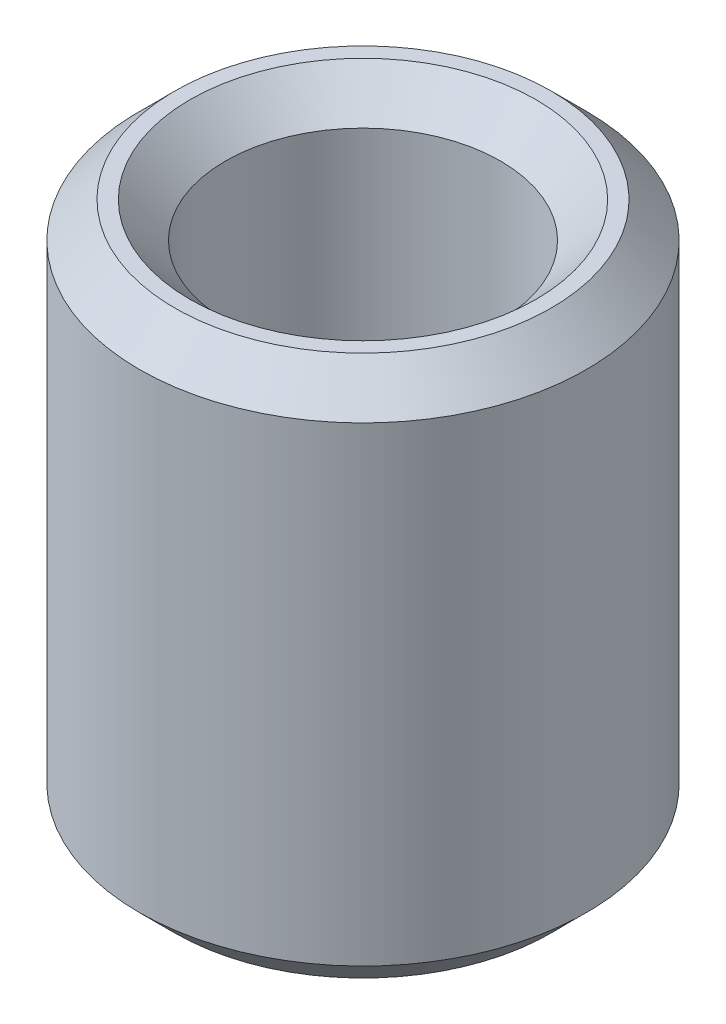
ISO-10303-21;
HEADER;
FILE_DESCRIPTION(('STEP AP214'),'2;1');
FILE_NAME('part.step','',(''),(''),'','','');
FILE_SCHEMA(('AUTOMOTIVE_DESIGN { 1 0 10303 214 1 1 1 1 }'));
ENDSEC;
DATA;
#1=APPLICATION_CONTEXT('core data for automotive mechanical design processes');
#2=APPLICATION_PROTOCOL_DEFINITION('international standard','automotive_design',2000,#1);
#3=PRODUCT_CONTEXT('',#1,'mechanical');
#4=PRODUCT('Part','Part','',(#3));
#5=PRODUCT_RELATED_PRODUCT_CATEGORY('part','',(#4));
#6=PRODUCT_DEFINITION_FORMATION('','',#4);
#7=PRODUCT_DEFINITION_CONTEXT('part definition',#1,'design');
#8=PRODUCT_DEFINITION('design','',#6,#7);
#9=PRODUCT_DEFINITION_SHAPE('','',#8);
#10=(LENGTH_UNIT() NAMED_UNIT(*) SI_UNIT(.MILLI.,.METRE.));
#11=(NAMED_UNIT(*) PLANE_ANGLE_UNIT() SI_UNIT($,.RADIAN.));
#12=(NAMED_UNIT(*) SI_UNIT($,.STERADIAN.) SOLID_ANGLE_UNIT());
#13=UNCERTAINTY_MEASURE_WITH_UNIT(LENGTH_MEASURE(1.E-05),#10,'distance_accuracy_value','');
#14=(GEOMETRIC_REPRESENTATION_CONTEXT(3) GLOBAL_UNCERTAINTY_ASSIGNED_CONTEXT((#13)) GLOBAL_UNIT_ASSIGNED_CONTEXT((#10,
#11,#12)) REPRESENTATION_CONTEXT('',''));
#15=CARTESIAN_POINT('',(0.,0.,0.));
#16=DIRECTION('',(0.,0.,1.));
#17=DIRECTION('',(1.,0.,0.));
#18=AXIS2_PLACEMENT_3D('',#15,#16,#17);
#19=CARTESIAN_POINT('',(0.,54.4717632460393,0.));
#20=DIRECTION('',(0.,-1.,0.));
#21=DIRECTION('',(0.,0.,-1.));
#22=AXIS2_PLACEMENT_3D('',#19,#20,#21);
#23=CYLINDRICAL_SURFACE('',#22,22.5);
#24=CARTESIAN_POINT('',(0.,3.56541825971917,0.));
#25=DIRECTION('',(0.,1.,0.));
#26=DIRECTION('',(0.,0.,1.));
#27=AXIS2_PLACEMENT_3D('',#24,#25,#26);
#28=CIRCLE('',#27,22.5);
#29=CARTESIAN_POINT('',(0.,3.56541825971917,-22.5));
#30=VERTEX_POINT('',#29);
#31=EDGE_CURVE('E10',#30,#30,#28,.T.);
#32=CARTESIAN_POINT('',(0.,50.9063449863202,0.));
#33=DIRECTION('',(0.,1.,0.));
#34=DIRECTION('',(0.,0.,1.));
#35=AXIS2_PLACEMENT_3D('',#32,#33,#34);
#36=CIRCLE('',#35,22.5);
#37=CARTESIAN_POINT('',(0.,50.9063449863202,-22.5));
#38=VERTEX_POINT('',#37);
#39=EDGE_CURVE('E50',#38,#38,#36,.F.);
#40=CARTESIAN_POINT('',(0.,3.56541825971917,-22.5));
#41=CARTESIAN_POINT('',(0.,4.05855291312126,-22.5));
#42=CARTESIAN_POINT('',(0.,4.55168756652336,-22.5));
#43=CARTESIAN_POINT('',(0.,5.53795687332755,-22.5));
#44=CARTESIAN_POINT('',(0.,6.03109152672964,-22.5));
#45=CARTESIAN_POINT('',(0.,7.01736083353383,-22.5));
#46=CARTESIAN_POINT('',(0.,7.51049548693592,-22.5));
#47=CARTESIAN_POINT('',(0.,8.49676479374011,-22.5));
#48=CARTESIAN_POINT('',(0.,8.98989944714221,-22.5));
#49=CARTESIAN_POINT('',(0.,9.9761687539464,-22.5));
#50=CARTESIAN_POINT('',(0.,10.4693034073485,-22.5));
#51=CARTESIAN_POINT('',(0.,11.4555727141527,-22.5));
#52=CARTESIAN_POINT('',(0.,11.9487073675548,-22.5));
#53=CARTESIAN_POINT('',(0.,12.934976674359,-22.5));
#54=CARTESIAN_POINT('',(0.,13.428111327761,-22.5));
#55=CARTESIAN_POINT('',(0.,14.4143806345652,-22.5));
#56=CARTESIAN_POINT('',(0.,14.9075152879673,-22.5));
#57=CARTESIAN_POINT('',(0.,15.8937845947715,-22.5));
#58=CARTESIAN_POINT('',(0.,16.3869192481736,-22.5));
#59=CARTESIAN_POINT('',(0.,17.3731885549778,-22.5));
#60=CARTESIAN_POINT('',(0.,17.8663232083799,-22.5));
#61=CARTESIAN_POINT('',(0.,18.8525925151841,-22.5));
#62=CARTESIAN_POINT('',(0.,19.3457271685862,-22.5));
#63=CARTESIAN_POINT('',(0.,20.3319964753904,-22.5));
#64=CARTESIAN_POINT('',(0.,20.8251311287925,-22.5));
#65=CARTESIAN_POINT('',(0.,21.8114004355966,-22.5));
#66=CARTESIAN_POINT('',(0.,22.3045350889987,-22.5));
#67=CARTESIAN_POINT('',(0.,23.2908043958029,-22.5));
#68=CARTESIAN_POINT('',(0.,23.783939049205,-22.5));
#69=CARTESIAN_POINT('',(0.,24.7702083560092,-22.5));
#70=CARTESIAN_POINT('',(0.,25.2633430094113,-22.5));
#71=CARTESIAN_POINT('',(0.,26.2496123162155,-22.5));
#72=CARTESIAN_POINT('',(0.,26.7427469696176,-22.5));
#73=CARTESIAN_POINT('',(0.,27.7290162764218,-22.5));
#74=CARTESIAN_POINT('',(0.,28.2221509298239,-22.5));
#75=CARTESIAN_POINT('',(0.,29.2084202366281,-22.5));
#76=CARTESIAN_POINT('',(0.,29.7015548900302,-22.5));
#77=CARTESIAN_POINT('',(0.,30.6878241968343,-22.5));
#78=CARTESIAN_POINT('',(0.,31.1809588502364,-22.5));
#79=CARTESIAN_POINT('',(0.,32.1672281570406,-22.5));
#80=CARTESIAN_POINT('',(0.,32.6603628104427,-22.5));
#81=CARTESIAN_POINT('',(0.,33.6466321172469,-22.5));
#82=CARTESIAN_POINT('',(0.,34.139766770649,-22.5));
#83=CARTESIAN_POINT('',(0.,35.1260360774532,-22.5));
#84=CARTESIAN_POINT('',(0.,35.6191707308553,-22.5));
#85=CARTESIAN_POINT('',(0.,36.6054400376595,-22.5));
#86=CARTESIAN_POINT('',(0.,37.0985746910616,-22.5));
#87=CARTESIAN_POINT('',(0.,38.0848439978658,-22.5));
#88=CARTESIAN_POINT('',(0.,38.5779786512678,-22.5));
#89=CARTESIAN_POINT('',(0.,39.564247958072,-22.5));
#90=CARTESIAN_POINT('',(0.,40.0573826114741,-22.5));
#91=CARTESIAN_POINT('',(0.,41.0436519182783,-22.5));
#92=CARTESIAN_POINT('',(0.,41.5367865716804,-22.5));
#93=CARTESIAN_POINT('',(0.,42.5230558784846,-22.5));
#94=CARTESIAN_POINT('',(0.,43.0161905318867,-22.5));
#95=CARTESIAN_POINT('',(0.,44.0024598386909,-22.5));
#96=CARTESIAN_POINT('',(0.,44.495594492093,-22.5));
#97=CARTESIAN_POINT('',(0.,45.4818637988972,-22.5));
#98=CARTESIAN_POINT('',(0.,45.9749984522993,-22.5));
#99=CARTESIAN_POINT('',(0.,46.9612677591034,-22.5));
#100=CARTESIAN_POINT('',(0.,47.4544024125055,-22.5));
#101=CARTESIAN_POINT('',(0.,48.4406717193097,-22.5));
#102=CARTESIAN_POINT('',(0.,48.9338063727118,-22.5));
#103=CARTESIAN_POINT('',(0.,49.920075679516,-22.5));
#104=CARTESIAN_POINT('',(0.,50.4132103329181,-22.5));
#105=CARTESIAN_POINT('',(0.,50.9063449863202,-22.5));
#106=B_SPLINE_CURVE_WITH_KNOTS('',3,(#40,#41,#42,#43,#44,#45,#46,#47,#48,#49,#50,#51,#52,#53,
#54,#55,#56,#57,#58,#59,#60,#61,#62,#63,#64,#65,#66,#67,#68,#69,#70,#71,#72,#73,#74,#75,#76,#77,
#78,#79,#80,#81,#82,#83,#84,#85,#86,#87,#88,#89,#90,#91,#92,#93,#94,#95,#96,#97,#98,#99,#100,
#101,#102,#103,#104,#105),.UNSPECIFIED.,.F.,.F.,(4,2,2,2,2,2,2,2,2,2,2,2,2,2,2,2,2,2,2,2,2,2,2,
2,2,2,2,2,2,2,2,2,4),(0.,1.47940396020628,2.95880792041257,4.43821188061885,5.91761584082513,
7.39701980103141,8.87642376123769,10.355827721444,11.8352316816503,13.3146356418565,
14.7940396020628,16.2734435622691,17.7528475224754,19.2322514826817,20.7116554428879,
22.1910594030942,23.6704633633005,25.1498673235068,26.6292712837131,28.1086752439194,
29.5880792041256,31.0674831643319,32.5468871245382,34.0262910847445,35.5056950449508,
36.985099005157,38.4645029653633,39.9439069255696,41.4233108857759,42.9027148459822,
44.3821188061885,45.8615227663947,47.340926726601),.UNSPECIFIED.);
#107=EDGE_CURVE('BSEAM39',#30,#38,#106,.T.);
#108=ORIENTED_EDGE('',*,*,#31,.T.);
#109=ORIENTED_EDGE('',*,*,#39,.T.);
#110=ORIENTED_EDGE('',*,*,#107,.T.);
#111=ORIENTED_EDGE('',*,*,#107,.F.);
#112=EDGE_LOOP('',(#108,#110,#109,#111));
#113=FACE_BOUND('',#112,.T.);
#114=ADVANCED_FACE('F39',(#113),#23,.T.);
#115=CARTESIAN_POINT('',(0.,54.4717632460393,0.));
#116=DIRECTION('',(0.,1.,0.));
#117=DIRECTION('',(0.,0.,1.));
#118=AXIS2_PLACEMENT_3D('',#115,#116,#117);
#119=PLANE('',#118);
#120=CARTESIAN_POINT('',(0.,54.4717632460393,0.));
#121=DIRECTION('',(0.,1.,0.));
#122=DIRECTION('',(0.,0.,1.));
#123=AXIS2_PLACEMENT_3D('',#120,#121,#122);
#124=CIRCLE('',#123,17.4126126283634);
#125=CARTESIAN_POINT('',(0.,54.4717632460393,17.4126126283634));
#126=VERTEX_POINT('',#125);
#127=EDGE_CURVE('E58',#126,#126,#124,.F.);
#128=ORIENTED_EDGE('',*,*,#127,.T.);
#129=EDGE_LOOP('',(#128));
#130=FACE_BOUND('',#129,.T.);
#131=CARTESIAN_POINT('',(0.,54.4717632460393,0.));
#132=DIRECTION('',(0.,1.,0.));
#133=DIRECTION('',(0.,0.,1.));
#134=AXIS2_PLACEMENT_3D('',#131,#132,#133);
#135=CIRCLE('',#134,18.9345817402809);
#136=CARTESIAN_POINT('',(0.,54.4717632460393,-18.9345817402809));
#137=VERTEX_POINT('',#136);
#138=EDGE_CURVE('E61',#137,#137,#135,.T.);
#139=ORIENTED_EDGE('',*,*,#138,.T.);
#140=EDGE_LOOP('',(#139));
#141=FACE_BOUND('',#140,.T.);
#142=ADVANCED_FACE('F88',(#130,#141),#119,.T.);
#143=CARTESIAN_POINT('',(0.,0.,0.));
#144=DIRECTION('',(0.,1.,0.));
#145=DIRECTION('',(0.,0.,1.));
#146=AXIS2_PLACEMENT_3D('',#143,#144,#145);
#147=PLANE('',#146);
#148=CARTESIAN_POINT('',(0.,0.,0.));
#149=DIRECTION('',(0.,1.,0.));
#150=DIRECTION('',(0.,0.,1.));
#151=AXIS2_PLACEMENT_3D('',#148,#149,#150);
#152=CIRCLE('',#151,17.4126126283634);
#153=CARTESIAN_POINT('',(0.,0.,17.4126126283634));
#154=VERTEX_POINT('',#153);
#155=EDGE_CURVE('E51',#154,#154,#152,.T.);
#156=ORIENTED_EDGE('',*,*,#155,.T.);
#157=EDGE_LOOP('',(#156));
#158=FACE_BOUND('',#157,.T.);
#159=CARTESIAN_POINT('',(0.,0.,0.));
#160=DIRECTION('',(0.,1.,0.));
#161=DIRECTION('',(0.,0.,1.));
#162=AXIS2_PLACEMENT_3D('',#159,#160,#161);
#163=CIRCLE('',#162,18.9345817402808);
#164=CARTESIAN_POINT('',(0.,0.,18.9345817402808));
#165=VERTEX_POINT('',#164);
#166=EDGE_CURVE('E54',#165,#165,#163,.F.);
#167=ORIENTED_EDGE('',*,*,#166,.T.);
#168=EDGE_LOOP('',(#167));
#169=FACE_BOUND('',#168,.T.);
#170=ADVANCED_FACE('F83',(#158,#169),#147,.F.);
#171=CARTESIAN_POINT('',(0.,54.4717632460393,0.));
#172=DIRECTION('',(0.,-1.,0.));
#173=DIRECTION('',(0.,0.,-1.));
#174=AXIS2_PLACEMENT_3D('',#171,#172,#173);
#175=CYLINDRICAL_SURFACE('',#174,13.8471943686442);
#176=CARTESIAN_POINT('',(0.,50.9063449863202,0.));
#177=DIRECTION('',(0.,1.,0.));
#178=DIRECTION('',(0.,0.,1.));
#179=AXIS2_PLACEMENT_3D('',#176,#177,#178);
#180=CIRCLE('',#179,13.8471943686442);
#181=CARTESIAN_POINT('',(0.,50.9063449863202,-13.8471943686442));
#182=VERTEX_POINT('',#181);
#183=EDGE_CURVE('E67',#182,#182,#180,.T.);
#184=CARTESIAN_POINT('',(0.,3.56541825971916,0.));
#185=DIRECTION('',(0.,1.,0.));
#186=DIRECTION('',(0.,0.,1.));
#187=AXIS2_PLACEMENT_3D('',#184,#185,#186);
#188=CIRCLE('',#187,13.8471943686442);
#189=CARTESIAN_POINT('',(0.,3.56541825971916,-13.8471943686442));
#190=VERTEX_POINT('',#189);
#191=EDGE_CURVE('E69',#190,#190,#188,.F.);
#192=CARTESIAN_POINT('',(0.,50.9063449863202,-13.8471943686442));
#193=CARTESIAN_POINT('',(0.,50.4132103329181,-13.8471943686442));
#194=CARTESIAN_POINT('',(0.,49.920075679516,-13.8471943686442));
#195=CARTESIAN_POINT('',(0.,48.9338063727118,-13.8471943686442));
#196=CARTESIAN_POINT('',(0.,48.4406717193097,-13.8471943686442));
#197=CARTESIAN_POINT('',(0.,47.4544024125055,-13.8471943686442));
#198=CARTESIAN_POINT('',(0.,46.9612677591034,-13.8471943686442));
#199=CARTESIAN_POINT('',(0.,45.9749984522992,-13.8471943686442));
#200=CARTESIAN_POINT('',(0.,45.4818637988971,-13.8471943686442));
#201=CARTESIAN_POINT('',(0.,44.4955944920929,-13.8471943686442));
#202=CARTESIAN_POINT('',(0.,44.0024598386909,-13.8471943686442));
#203=CARTESIAN_POINT('',(0.,43.0161905318867,-13.8471943686442));
#204=CARTESIAN_POINT('',(0.,42.5230558784846,-13.8471943686442));
#205=CARTESIAN_POINT('',(0.,41.5367865716804,-13.8471943686442));
#206=CARTESIAN_POINT('',(0.,41.0436519182783,-13.8471943686442));
#207=CARTESIAN_POINT('',(0.,40.0573826114741,-13.8471943686442));
#208=CARTESIAN_POINT('',(0.,39.564247958072,-13.8471943686442));
#209=CARTESIAN_POINT('',(0.,38.5779786512678,-13.8471943686442));
#210=CARTESIAN_POINT('',(0.,38.0848439978657,-13.8471943686442));
#211=CARTESIAN_POINT('',(0.,37.0985746910615,-13.8471943686442));
#212=CARTESIAN_POINT('',(0.,36.6054400376594,-13.8471943686442));
#213=CARTESIAN_POINT('',(0.,35.6191707308553,-13.8471943686442));
#214=CARTESIAN_POINT('',(0.,35.1260360774532,-13.8471943686442));
#215=CARTESIAN_POINT('',(0.,34.139766770649,-13.8471943686442));
#216=CARTESIAN_POINT('',(0.,33.6466321172469,-13.8471943686442));
#217=CARTESIAN_POINT('',(0.,32.6603628104427,-13.8471943686442));
#218=CARTESIAN_POINT('',(0.,32.1672281570406,-13.8471943686442));
#219=CARTESIAN_POINT('',(0.,31.1809588502364,-13.8471943686442));
#220=CARTESIAN_POINT('',(0.,30.6878241968343,-13.8471943686442));
#221=CARTESIAN_POINT('',(0.,29.7015548900301,-13.8471943686442));
#222=CARTESIAN_POINT('',(0.,29.208420236628,-13.8471943686442));
#223=CARTESIAN_POINT('',(0.,28.2221509298239,-13.8471943686442));
#224=CARTESIAN_POINT('',(0.,27.7290162764218,-13.8471943686442));
#225=CARTESIAN_POINT('',(0.,26.7427469696176,-13.8471943686442));
#226=CARTESIAN_POINT('',(0.,26.2496123162155,-13.8471943686442));
#227=CARTESIAN_POINT('',(0.,25.2633430094113,-13.8471943686442));
#228=CARTESIAN_POINT('',(0.,24.7702083560092,-13.8471943686442));
#229=CARTESIAN_POINT('',(0.,23.783939049205,-13.8471943686442));
#230=CARTESIAN_POINT('',(0.,23.2908043958029,-13.8471943686442));
#231=CARTESIAN_POINT('',(0.,22.3045350889987,-13.8471943686442));
#232=CARTESIAN_POINT('',(0.,21.8114004355966,-13.8471943686442));
#233=CARTESIAN_POINT('',(0.,20.8251311287924,-13.8471943686442));
#234=CARTESIAN_POINT('',(0.,20.3319964753904,-13.8471943686442));
#235=CARTESIAN_POINT('',(0.,19.3457271685862,-13.8471943686442));
#236=CARTESIAN_POINT('',(0.,18.8525925151841,-13.8471943686442));
#237=CARTESIAN_POINT('',(0.,17.8663232083799,-13.8471943686442));
#238=CARTESIAN_POINT('',(0.,17.3731885549778,-13.8471943686442));
#239=CARTESIAN_POINT('',(0.,16.3869192481736,-13.8471943686442));
#240=CARTESIAN_POINT('',(0.,15.8937845947715,-13.8471943686442));
#241=CARTESIAN_POINT('',(0.,14.9075152879673,-13.8471943686442));
#242=CARTESIAN_POINT('',(0.,14.4143806345652,-13.8471943686442));
#243=CARTESIAN_POINT('',(0.,13.428111327761,-13.8471943686442));
#244=CARTESIAN_POINT('',(0.,12.9349766743589,-13.8471943686442));
#245=CARTESIAN_POINT('',(0.,11.9487073675548,-13.8471943686442));
#246=CARTESIAN_POINT('',(0.,11.4555727141527,-13.8471943686442));
#247=CARTESIAN_POINT('',(0.,10.4693034073485,-13.8471943686442));
#248=CARTESIAN_POINT('',(0.,9.97616875394638,-13.8471943686442));
#249=CARTESIAN_POINT('',(0.,8.98989944714219,-13.8471943686442));
#250=CARTESIAN_POINT('',(0.,8.4967647937401,-13.8471943686442));
#251=CARTESIAN_POINT('',(0.,7.51049548693591,-13.8471943686442));
#252=CARTESIAN_POINT('',(0.,7.01736083353382,-13.8471943686442));
#253=CARTESIAN_POINT('',(0.,6.03109152672963,-13.8471943686442));
#254=CARTESIAN_POINT('',(0.,5.53795687332753,-13.8471943686442));
#255=CARTESIAN_POINT('',(0.,4.55168756652334,-13.8471943686442));
#256=CARTESIAN_POINT('',(0.,4.05855291312125,-13.8471943686442));
#257=CARTESIAN_POINT('',(0.,3.56541825971916,-13.8471943686442));
#258=B_SPLINE_CURVE_WITH_KNOTS('',3,(#192,#193,#194,#195,#196,#197,#198,#199,#200,#201,#202,
#203,#204,#205,#206,#207,#208,#209,#210,#211,#212,#213,#214,#215,#216,#217,#218,#219,#220,#221,
#222,#223,#224,#225,#226,#227,#228,#229,#230,#231,#232,#233,#234,#235,#236,#237,#238,#239,#240,
#241,#242,#243,#244,#245,#246,#247,#248,#249,#250,#251,#252,#253,#254,#255,#256,#257),
.UNSPECIFIED.,.F.,.F.,(4,2,2,2,2,2,2,2,2,2,2,2,2,2,2,2,2,2,2,2,2,2,2,2,2,2,2,2,2,2,2,2,4),(0.,
1.47940396020628,2.95880792041256,4.43821188061884,5.91761584082513,7.39701980103141,
8.87642376123769,10.355827721444,11.8352316816503,13.3146356418565,14.7940396020628,
16.2734435622691,17.7528475224754,19.2322514826817,20.7116554428879,22.1910594030942,
23.6704633633005,25.1498673235068,26.6292712837131,28.1086752439193,29.5880792041256,
31.0674831643319,32.5468871245382,34.0262910847445,35.5056950449508,36.985099005157,
38.4645029653633,39.9439069255696,41.4233108857759,42.9027148459822,44.3821188061884,
45.8615227663947,47.340926726601),.UNSPECIFIED.);
#259=EDGE_CURVE('BSEAM71',#182,#190,#258,.T.);
#260=ORIENTED_EDGE('',*,*,#183,.T.);
#261=ORIENTED_EDGE('',*,*,#191,.T.);
#262=ORIENTED_EDGE('',*,*,#259,.T.);
#263=ORIENTED_EDGE('',*,*,#259,.F.);
#264=EDGE_LOOP('',(#260,#262,#261,#263));
#265=FACE_BOUND('',#264,.T.);
#266=ADVANCED_FACE('F71',(#265),#175,.F.);
#267=CARTESIAN_POINT('',(0.,50.9063449863202,0.));
#268=DIRECTION('',(0.,1.,0.));
#269=DIRECTION('',(0.,0.,1.));
#270=AXIS2_PLACEMENT_3D('',#267,#268,#269);
#271=CONICAL_SURFACE('',#270,13.8471943686442,0.785398163397452);
#272=ORIENTED_EDGE('',*,*,#127,.F.);
#273=EDGE_LOOP('',(#272));
#274=FACE_BOUND('',#273,.T.);
#275=ORIENTED_EDGE('',*,*,#183,.F.);
#276=EDGE_LOOP('',(#275));
#277=FACE_BOUND('',#276,.T.);
#278=ADVANCED_FACE('F77',(#274,#277),#271,.F.);
#279=CARTESIAN_POINT('',(0.,0.,0.));
#280=DIRECTION('',(0.,-1.,0.));
#281=DIRECTION('',(0.,0.,-1.));
#282=AXIS2_PLACEMENT_3D('',#279,#280,#281);
#283=CONICAL_SURFACE('',#282,17.4126126283634,0.785398163397444);
#284=ORIENTED_EDGE('',*,*,#191,.F.);
#285=EDGE_LOOP('',(#284));
#286=FACE_BOUND('',#285,.T.);
#287=ORIENTED_EDGE('',*,*,#155,.F.);
#288=EDGE_LOOP('',(#287));
#289=FACE_BOUND('',#288,.T.);
#290=ADVANCED_FACE('F73',(#286,#289),#283,.F.);
#291=CARTESIAN_POINT('',(0.,3.56541825971917,0.));
#292=DIRECTION('',(0.,1.,0.));
#293=DIRECTION('',(0.,0.,1.));
#294=AXIS2_PLACEMENT_3D('',#291,#292,#293);
#295=CONICAL_SURFACE('',#294,22.5,0.785398163397451);
#296=ORIENTED_EDGE('',*,*,#166,.F.);
#297=EDGE_LOOP('',(#296));
#298=FACE_BOUND('',#297,.T.);
#299=ORIENTED_EDGE('',*,*,#31,.F.);
#300=EDGE_LOOP('',(#299));
#301=FACE_BOUND('',#300,.T.);
#302=ADVANCED_FACE('F76',(#298,#301),#295,.T.);
#303=CARTESIAN_POINT('',(0.,54.4717632460393,0.));
#304=DIRECTION('',(0.,-1.,0.));
#305=DIRECTION('',(0.,0.,-1.));
#306=AXIS2_PLACEMENT_3D('',#303,#304,#305);
#307=CONICAL_SURFACE('',#306,18.9345817402809,0.785398163397442);
#308=CARTESIAN_POINT('',(0.,50.9063449863202,-22.5));
#309=CARTESIAN_POINT('',(0.,50.9434847598589,-22.4628602264613));
#310=CARTESIAN_POINT('',(0.,50.9806245333977,-22.4257204529225));
#311=CARTESIAN_POINT('',(0.,51.0549040804752,-22.351440905845));
#312=CARTESIAN_POINT('',(0.,51.0920438540139,-22.3143011323063));
#313=CARTESIAN_POINT('',(0.,51.1663234010914,-22.2400215852288));
#314=CARTESIAN_POINT('',(0.,51.2034631746301,-22.2028818116901));
#315=CARTESIAN_POINT('',(0.,51.2777427217076,-22.1286022646126));
#316=CARTESIAN_POINT('',(0.,51.3148824952464,-22.0914624910739));
#317=CARTESIAN_POINT('',(0.,51.3891620423238,-22.0171829439964));
#318=CARTESIAN_POINT('',(0.,51.4263018158626,-21.9800431704576));
#319=CARTESIAN_POINT('',(0.,51.5005813629401,-21.9057636233802));
#320=CARTESIAN_POINT('',(0.,51.5377211364788,-21.8686238498414));
#321=CARTESIAN_POINT('',(0.,51.6120006835563,-21.7943443027639));
#322=CARTESIAN_POINT('',(0.,51.649140457095,-21.7572045292252));
#323=CARTESIAN_POINT('',(0.,51.7234200041725,-21.6829249821477));
#324=CARTESIAN_POINT('',(0.,51.7605597777113,-21.645785208609));
#325=CARTESIAN_POINT('',(0.,51.8348393247887,-21.5715056615315));
#326=CARTESIAN_POINT('',(0.,51.8719790983275,-21.5343658879928));
#327=CARTESIAN_POINT('',(0.,51.9462586454049,-21.4600863409153));
#328=CARTESIAN_POINT('',(0.,51.9833984189437,-21.4229465673765));
#329=CARTESIAN_POINT('',(0.,52.0576779660212,-21.3486670202991));
#330=CARTESIAN_POINT('',(0.,52.0948177395599,-21.3115272467603));
#331=CARTESIAN_POINT('',(0.,52.1690972866374,-21.2372476996828));
#332=CARTESIAN_POINT('',(0.,52.2062370601761,-21.2001079261441));
#333=CARTESIAN_POINT('',(0.,52.2805166072536,-21.1258283790666));
#334=CARTESIAN_POINT('',(0.,52.3176563807924,-21.0886886055279));
#335=CARTESIAN_POINT('',(0.,52.3919359278698,-21.0144090584504));
#336=CARTESIAN_POINT('',(0.,52.4290757014086,-20.9772692849116));
#337=CARTESIAN_POINT('',(0.,52.5033552484861,-20.9029897378342));
#338=CARTESIAN_POINT('',(0.,52.5404950220248,-20.8658499642954));
#339=CARTESIAN_POINT('',(0.,52.6147745691023,-20.7915704172179));
#340=CARTESIAN_POINT('',(0.,52.651914342641,-20.7544306436792));
#341=CARTESIAN_POINT('',(0.,52.7261938897185,-20.6801510966017));
#342=CARTESIAN_POINT('',(0.,52.7633336632572,-20.643011323063));
#343=CARTESIAN_POINT('',(0.,52.8376132103347,-20.5687317759855));
#344=CARTESIAN_POINT('',(0.,52.8747529838735,-20.5315920024468));
#345=CARTESIAN_POINT('',(0.,52.949032530951,-20.4573124553693));
#346=CARTESIAN_POINT('',(0.,52.9861723044897,-20.4201726818305));
#347=CARTESIAN_POINT('',(0.,53.0604518515672,-20.3458931347531));
#348=CARTESIAN_POINT('',(0.,53.0975916251059,-20.3087533612143));
#349=CARTESIAN_POINT('',(0.,53.1718711721834,-20.2344738141368));
#350=CARTESIAN_POINT('',(0.,53.2090109457221,-20.1973340405981));
#351=CARTESIAN_POINT('',(0.,53.2832904927996,-20.1230544935206));
#352=CARTESIAN_POINT('',(0.,53.3204302663384,-20.0859147199819));
#353=CARTESIAN_POINT('',(0.,53.3947098134158,-20.0116351729044));
#354=CARTESIAN_POINT('',(0.,53.4318495869546,-19.9744953993657));
#355=CARTESIAN_POINT('',(0.,53.5061291340321,-19.9002158522882));
#356=CARTESIAN_POINT('',(0.,53.5432689075708,-19.8630760787494));
#357=CARTESIAN_POINT('',(0.,53.6175484546483,-19.788796531672));
#358=CARTESIAN_POINT('',(0.,53.654688228187,-19.7516567581332));
#359=CARTESIAN_POINT('',(0.,53.7289677752645,-19.6773772110557));
#360=CARTESIAN_POINT('',(0.,53.7661075488033,-19.640237437517));
#361=CARTESIAN_POINT('',(0.,53.8403870958807,-19.5659578904395));
#362=CARTESIAN_POINT('',(0.,53.8775268694195,-19.5288181169008));
#363=CARTESIAN_POINT('',(0.,53.951806416497,-19.4545385698233));
#364=CARTESIAN_POINT('',(0.,53.9889461900357,-19.4173987962846));
#365=CARTESIAN_POINT('',(0.,54.0632257371132,-19.3431192492071));
#366=CARTESIAN_POINT('',(0.,54.1003655106519,-19.3059794756683));
#367=CARTESIAN_POINT('',(0.,54.1746450577294,-19.2316999285908));
#368=CARTESIAN_POINT('',(0.,54.2117848312681,-19.1945601550521));
#369=CARTESIAN_POINT('',(0.,54.2860643783456,-19.1202806079746));
#370=CARTESIAN_POINT('',(0.,54.3232041518844,-19.0831408344359));
#371=CARTESIAN_POINT('',(0.,54.3974836989619,-19.0088612873584));
#372=CARTESIAN_POINT('',(0.,54.4346234725006,-18.9717215138197));
#373=CARTESIAN_POINT('',(0.,54.4717632460393,-18.9345817402809));
#374=B_SPLINE_CURVE_WITH_KNOTS('',3,(#308,#309,#310,#311,#312,#313,#314,#315,#316,#317,#318,
#319,#320,#321,#322,#323,#324,#325,#326,#327,#328,#329,#330,#331,#332,#333,#334,#335,#336,#337,
#338,#339,#340,#341,#342,#343,#344,#345,#346,#347,#348,#349,#350,#351,#352,#353,#354,#355,#356,
#357,#358,#359,#360,#361,#362,#363,#364,#365,#366,#367,#368,#369,#370,#371,#372,#373),
.UNSPECIFIED.,.F.,.F.,(4,2,2,2,2,2,2,2,2,2,2,2,2,2,2,2,2,2,2,2,2,2,2,2,2,2,2,2,2,2,2,2,4),(0.,
0.157570714325858,0.315141428651714,0.472712142977572,0.630282857303428,0.787853571629286,
0.945424285955144,1.102995000281,1.26056571460686,1.41813642893272,1.57570714325857,
1.73327785758443,1.89084857191029,2.04841928623614,2.205990000562,2.36356071488786,
2.52113142921372,2.67870214353957,2.83627285786543,2.99384357219129,3.15141428651714,
3.308985000843,3.46655571516886,3.62412642949471,3.78169714382057,3.93926785814643,
4.09683857247229,4.25440928679814,4.411980001124,4.56955071544986,4.72712142977572,
4.88469214410158,5.04226285842743),.UNSPECIFIED.);
#375=EDGE_CURVE('BSEAM45',#38,#137,#374,.T.);
#376=ORIENTED_EDGE('',*,*,#39,.F.);
#377=ORIENTED_EDGE('',*,*,#138,.F.);
#378=ORIENTED_EDGE('',*,*,#375,.T.);
#379=ORIENTED_EDGE('',*,*,#375,.F.);
#380=EDGE_LOOP('',(#376,#378,#377,#379));
#381=FACE_BOUND('',#380,.T.);
#382=ADVANCED_FACE('F45',(#381),#307,.T.);
#383=CLOSED_SHELL('',(#114,#142,#170,#266,#278,#290,#302,#382));
#384=MANIFOLD_SOLID_BREP('B2',#383);
#385=ADVANCED_BREP_SHAPE_REPRESENTATION('',(#18,#384),#14);
#386=SHAPE_DEFINITION_REPRESENTATION(#9,#385);
ENDSEC;
END-ISO-10303-21;
